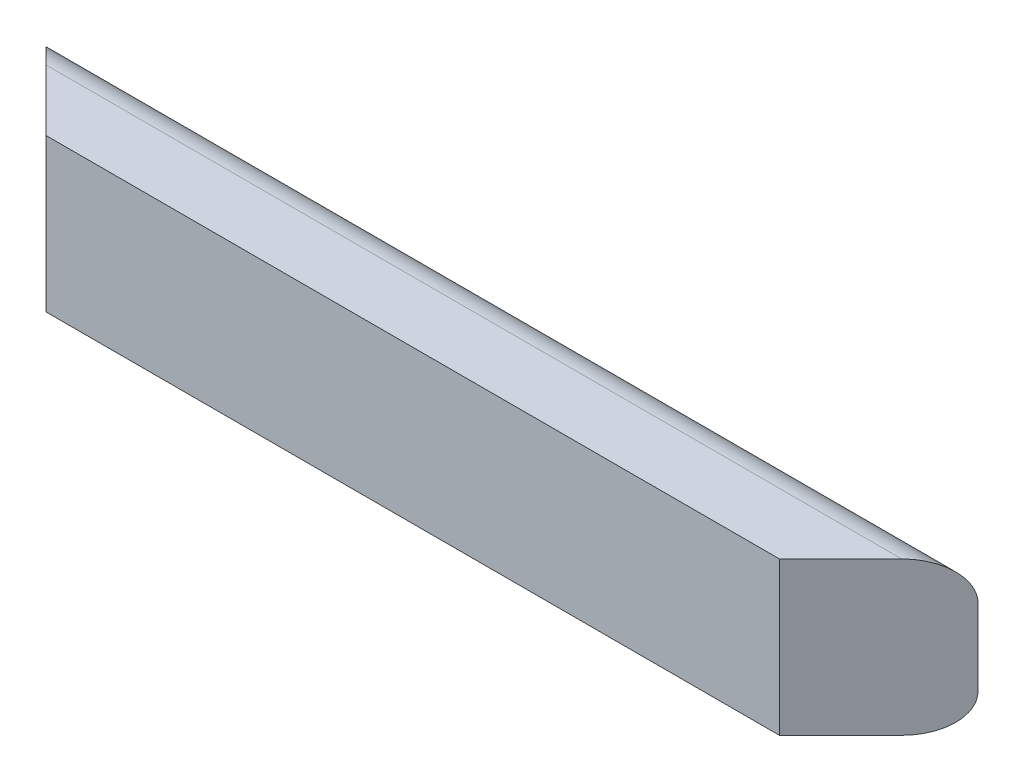
ISO-10303-21;
HEADER;
FILE_DESCRIPTION(('STEP AP214'),'2;1');
FILE_NAME('part.step','',(''),(''),'','','');
FILE_SCHEMA(('AUTOMOTIVE_DESIGN { 1 0 10303 214 1 1 1 1 }'));
ENDSEC;
DATA;
#1=APPLICATION_CONTEXT('core data for automotive mechanical design processes');
#2=APPLICATION_PROTOCOL_DEFINITION('international standard','automotive_design',2000,#1);
#3=PRODUCT_CONTEXT('',#1,'mechanical');
#4=PRODUCT('Part','Part','',(#3));
#5=PRODUCT_RELATED_PRODUCT_CATEGORY('part','',(#4));
#6=PRODUCT_DEFINITION_FORMATION('','',#4);
#7=PRODUCT_DEFINITION_CONTEXT('part definition',#1,'design');
#8=PRODUCT_DEFINITION('design','',#6,#7);
#9=PRODUCT_DEFINITION_SHAPE('','',#8);
#10=(LENGTH_UNIT() NAMED_UNIT(*) SI_UNIT(.MILLI.,.METRE.));
#11=(NAMED_UNIT(*) PLANE_ANGLE_UNIT() SI_UNIT($,.RADIAN.));
#12=(NAMED_UNIT(*) SI_UNIT($,.STERADIAN.) SOLID_ANGLE_UNIT());
#13=UNCERTAINTY_MEASURE_WITH_UNIT(LENGTH_MEASURE(1.E-05),#10,'distance_accuracy_value','');
#14=(GEOMETRIC_REPRESENTATION_CONTEXT(3) GLOBAL_UNCERTAINTY_ASSIGNED_CONTEXT((#13)) GLOBAL_UNIT_ASSIGNED_CONTEXT((#10,
#11,#12)) REPRESENTATION_CONTEXT('',''));
#15=CARTESIAN_POINT('',(0.,0.,0.));
#16=DIRECTION('',(0.,0.,1.));
#17=DIRECTION('',(1.,0.,0.));
#18=AXIS2_PLACEMENT_3D('',#15,#16,#17);
#19=CARTESIAN_POINT('',(774.7,0.,0.));
#20=DIRECTION('',(0.,1.,0.));
#21=DIRECTION('',(0.,0.,1.));
#22=AXIS2_PLACEMENT_3D('',#19,#20,#21);
#23=PLANE('',#22);
#24=DIRECTION('',(-1.,0.,0.));
#25=VECTOR('',#24,1.);
#26=CARTESIAN_POINT('',(774.7,0.,19.05));
#27=LINE('',#26,#25);
#28=CARTESIAN_POINT('',(692.15,0.,19.05));
#29=VERTEX_POINT('',#28);
#30=CARTESIAN_POINT('',(82.5500000000001,0.,19.05));
#31=VERTEX_POINT('',#30);
#32=EDGE_CURVE('E110',#29,#31,#27,.T.);
#33=ORIENTED_EDGE('',*,*,#32,.T.);
#34=DIRECTION('',(-0.707106781186549,0.,-0.707106781186546));
#35=VECTOR('',#34,1.);
#36=CARTESIAN_POINT('',(419.100000000001,0.,355.6));
#37=LINE('',#36,#35);
#38=CARTESIAN_POINT('',(31.7499999999998,0.,-31.7499999999999));
#39=VERTEX_POINT('',#38);
#40=EDGE_CURVE('E98',#31,#39,#37,.T.);
#41=ORIENTED_EDGE('',*,*,#40,.T.);
#42=DIRECTION('',(-1.,0.,0.));
#43=VECTOR('',#42,1.);
#44=CARTESIAN_POINT('',(774.7,0.,-31.75));
#45=LINE('',#44,#43);
#46=CARTESIAN_POINT('',(742.95,0.,-31.75));
#47=VERTEX_POINT('',#46);
#48=EDGE_CURVE('E11',#47,#39,#45,.T.);
#49=ORIENTED_EDGE('',*,*,#48,.F.);
#50=DIRECTION('',(-0.707106781186549,0.,0.707106781186546));
#51=VECTOR('',#50,1.);
#52=CARTESIAN_POINT('',(742.95,0.,-31.75));
#53=LINE('',#52,#51);
#54=EDGE_CURVE('E115',#47,#29,#53,.T.);
#55=ORIENTED_EDGE('',*,*,#54,.T.);
#56=EDGE_LOOP('',(#33,#41,#49,#55));
#57=FACE_BOUND('',#56,.T.);
#58=ADVANCED_FACE('F33',(#57),#23,.F.);
#59=CARTESIAN_POINT('',(774.7,31.75,-31.75));
#60=DIRECTION('',(-1.,0.,0.));
#61=DIRECTION('',(0.,0.,1.));
#62=AXIS2_PLACEMENT_3D('',#59,#60,#61);
#63=CYLINDRICAL_SURFACE('',#62,31.75);
#64=ORIENTED_EDGE('',*,*,#48,.T.);
#65=CARTESIAN_POINT('',(31.7499999999997,31.75,-31.75));
#66=DIRECTION('',(0.707106781186546,0.,-0.707106781186549));
#67=DIRECTION('',(-0.707106781186549,0.,-0.707106781186546));
#68=AXIS2_PLACEMENT_3D('',#65,#66,#67);
#69=ELLIPSE('',#68,44.9012806053458,31.75);
#70=CARTESIAN_POINT('',(0.,31.75,-63.4999999999998));
#71=VERTEX_POINT('',#70);
#72=EDGE_CURVE('E83',#39,#71,#69,.T.);
#73=ORIENTED_EDGE('',*,*,#72,.T.);
#74=DIRECTION('',(-1.,0.,0.));
#75=VECTOR('',#74,1.);
#76=CARTESIAN_POINT('',(774.7,31.75,-63.5));
#77=LINE('',#76,#75);
#78=CARTESIAN_POINT('',(774.7,31.75,-63.5));
#79=VERTEX_POINT('',#78);
#80=EDGE_CURVE('E41',#79,#71,#77,.T.);
#81=ORIENTED_EDGE('',*,*,#80,.F.);
#82=CARTESIAN_POINT('',(742.95,31.75,-31.75));
#83=DIRECTION('',(-0.707106781186546,0.,-0.707106781186549));
#84=DIRECTION('',(-0.707106781186549,0.,0.707106781186546));
#85=AXIS2_PLACEMENT_3D('',#82,#83,#84);
#86=ELLIPSE('',#85,44.9012806053458,31.75);
#87=EDGE_CURVE('E47',#79,#47,#86,.T.);
#88=ORIENTED_EDGE('',*,*,#87,.T.);
#89=EDGE_LOOP('',(#64,#73,#81,#88));
#90=FACE_BOUND('',#89,.T.);
#91=ADVANCED_FACE('F94',(#90),#63,.T.);
#92=CARTESIAN_POINT('',(774.7,95.25,-63.5));
#93=DIRECTION('',(0.,0.,1.));
#94=DIRECTION('',(1.,0.,0.));
#95=AXIS2_PLACEMENT_3D('',#92,#93,#94);
#96=PLANE('',#95);
#97=DIRECTION('',(0.,1.,0.));
#98=VECTOR('',#97,1.);
#99=CARTESIAN_POINT('',(0.,95.25,-63.5));
#100=LINE('',#99,#98);
#101=CARTESIAN_POINT('',(0.,95.25,-63.5));
#102=VERTEX_POINT('',#101);
#103=EDGE_CURVE('E80',#71,#102,#100,.T.);
#104=ORIENTED_EDGE('',*,*,#103,.T.);
#105=DIRECTION('',(-1.,0.,0.));
#106=VECTOR('',#105,1.);
#107=CARTESIAN_POINT('',(774.7,95.25,-63.5));
#108=LINE('',#107,#106);
#109=CARTESIAN_POINT('',(774.7,95.25,-63.4999999999998));
#110=VERTEX_POINT('',#109);
#111=EDGE_CURVE('E101',#110,#102,#108,.T.);
#112=ORIENTED_EDGE('',*,*,#111,.F.);
#113=DIRECTION('',(0.,1.,0.));
#114=VECTOR('',#113,1.);
#115=CARTESIAN_POINT('',(774.7,95.25,-63.5));
#116=LINE('',#115,#114);
#117=EDGE_CURVE('E91',#79,#110,#116,.T.);
#118=ORIENTED_EDGE('',*,*,#117,.F.);
#119=ORIENTED_EDGE('',*,*,#80,.T.);
#120=EDGE_LOOP('',(#104,#112,#118,#119));
#121=FACE_BOUND('',#120,.T.);
#122=ADVANCED_FACE('F100',(#121),#96,.F.);
#123=CARTESIAN_POINT('',(774.7,95.25,-31.75));
#124=DIRECTION('',(-1.,0.,0.));
#125=DIRECTION('',(0.,0.,1.));
#126=AXIS2_PLACEMENT_3D('',#123,#124,#125);
#127=CYLINDRICAL_SURFACE('',#126,31.75);
#128=ORIENTED_EDGE('',*,*,#111,.T.);
#129=CARTESIAN_POINT('',(31.7499999999997,95.25,-31.75));
#130=DIRECTION('',(0.707106781186546,0.,-0.707106781186549));
#131=DIRECTION('',(-0.707106781186549,0.,-0.707106781186546));
#132=AXIS2_PLACEMENT_3D('',#129,#130,#131);
#133=ELLIPSE('',#132,44.9012806053458,31.75);
#134=CARTESIAN_POINT('',(31.7499999999997,127.,-31.75));
#135=VERTEX_POINT('',#134);
#136=EDGE_CURVE('E86',#102,#135,#133,.T.);
#137=ORIENTED_EDGE('',*,*,#136,.T.);
#138=DIRECTION('',(-1.,0.,0.));
#139=VECTOR('',#138,1.);
#140=CARTESIAN_POINT('',(774.7,127.,-31.75));
#141=LINE('',#140,#139);
#142=CARTESIAN_POINT('',(742.95,127.,-31.75));
#143=VERTEX_POINT('',#142);
#144=EDGE_CURVE('E102',#143,#135,#141,.T.);
#145=ORIENTED_EDGE('',*,*,#144,.F.);
#146=CARTESIAN_POINT('',(742.95,95.25,-31.75));
#147=DIRECTION('',(-0.707106781186546,0.,-0.707106781186549));
#148=DIRECTION('',(-0.707106781186549,0.,0.707106781186546));
#149=AXIS2_PLACEMENT_3D('',#146,#147,#148);
#150=ELLIPSE('',#149,44.9012806053458,31.75);
#151=EDGE_CURVE('E97',#143,#110,#150,.T.);
#152=ORIENTED_EDGE('',*,*,#151,.T.);
#153=EDGE_LOOP('',(#128,#137,#145,#152));
#154=FACE_BOUND('',#153,.T.);
#155=ADVANCED_FACE('F135',(#154),#127,.T.);
#156=CARTESIAN_POINT('',(774.7,127.,19.05));
#157=DIRECTION('',(0.,-1.,0.));
#158=DIRECTION('',(0.,0.,-1.));
#159=AXIS2_PLACEMENT_3D('',#156,#157,#158);
#160=PLANE('',#159);
#161=ORIENTED_EDGE('',*,*,#144,.T.);
#162=DIRECTION('',(0.707106781186549,0.,0.707106781186546));
#163=VECTOR('',#162,1.);
#164=CARTESIAN_POINT('',(428.625000000001,127.,365.125));
#165=LINE('',#164,#163);
#166=CARTESIAN_POINT('',(82.55,127.,19.05));
#167=VERTEX_POINT('',#166);
#168=EDGE_CURVE('E130',#135,#167,#165,.T.);
#169=ORIENTED_EDGE('',*,*,#168,.T.);
#170=DIRECTION('',(-1.,0.,0.));
#171=VECTOR('',#170,1.);
#172=CARTESIAN_POINT('',(774.7,127.,19.05));
#173=LINE('',#172,#171);
#174=CARTESIAN_POINT('',(692.15,127.,19.05));
#175=VERTEX_POINT('',#174);
#176=EDGE_CURVE('E107',#175,#167,#173,.T.);
#177=ORIENTED_EDGE('',*,*,#176,.F.);
#178=DIRECTION('',(0.707106781186549,0.,-0.707106781186546));
#179=VECTOR('',#178,1.);
#180=CARTESIAN_POINT('',(733.425,127.,-22.2250000000001));
#181=LINE('',#180,#179);
#182=EDGE_CURVE('E121',#175,#143,#181,.T.);
#183=ORIENTED_EDGE('',*,*,#182,.T.);
#184=EDGE_LOOP('',(#161,#169,#177,#183));
#185=FACE_BOUND('',#184,.T.);
#186=ADVANCED_FACE('F137',(#185),#160,.F.);
#187=CARTESIAN_POINT('',(774.7,0.,19.05));
#188=DIRECTION('',(0.,0.,-1.));
#189=DIRECTION('',(-1.,0.,0.));
#190=AXIS2_PLACEMENT_3D('',#187,#188,#189);
#191=PLANE('',#190);
#192=ORIENTED_EDGE('',*,*,#176,.T.);
#193=DIRECTION('',(0.,-1.,0.));
#194=VECTOR('',#193,1.);
#195=CARTESIAN_POINT('',(82.5500000000001,0.,19.05));
#196=LINE('',#195,#194);
#197=EDGE_CURVE('E127',#167,#31,#196,.T.);
#198=ORIENTED_EDGE('',*,*,#197,.T.);
#199=ORIENTED_EDGE('',*,*,#32,.F.);
#200=DIRECTION('',(0.,1.,0.));
#201=VECTOR('',#200,1.);
#202=CARTESIAN_POINT('',(692.15,0.,19.05));
#203=LINE('',#202,#201);
#204=EDGE_CURVE('E118',#29,#175,#203,.T.);
#205=ORIENTED_EDGE('',*,*,#204,.T.);
#206=EDGE_LOOP('',(#192,#198,#199,#205));
#207=FACE_BOUND('',#206,.T.);
#208=ADVANCED_FACE('F142',(#207),#191,.F.);
#209=CARTESIAN_POINT('',(355.599999999999,0.,355.6));
#210=DIRECTION('',(-0.707106781186546,0.,-0.707106781186549));
#211=DIRECTION('',(-0.707106781186549,0.,0.707106781186546));
#212=AXIS2_PLACEMENT_3D('',#209,#210,#211);
#213=PLANE('',#212);
#214=ORIENTED_EDGE('',*,*,#117,.T.);
#215=ORIENTED_EDGE('',*,*,#151,.F.);
#216=ORIENTED_EDGE('',*,*,#182,.F.);
#217=ORIENTED_EDGE('',*,*,#204,.F.);
#218=ORIENTED_EDGE('',*,*,#54,.F.);
#219=ORIENTED_EDGE('',*,*,#87,.F.);
#220=EDGE_LOOP('',(#214,#215,#216,#217,#218,#219));
#221=FACE_BOUND('',#220,.T.);
#222=ADVANCED_FACE('F139',(#221),#213,.F.);
#223=CARTESIAN_POINT('',(419.100000000001,0.,355.6));
#224=DIRECTION('',(0.707106781186546,0.,-0.707106781186549));
#225=DIRECTION('',(0.707106781186549,0.,0.707106781186546));
#226=AXIS2_PLACEMENT_3D('',#223,#224,#225);
#227=PLANE('',#226);
#228=ORIENTED_EDGE('',*,*,#40,.F.);
#229=ORIENTED_EDGE('',*,*,#197,.F.);
#230=ORIENTED_EDGE('',*,*,#168,.F.);
#231=ORIENTED_EDGE('',*,*,#136,.F.);
#232=ORIENTED_EDGE('',*,*,#103,.F.);
#233=ORIENTED_EDGE('',*,*,#72,.F.);
#234=EDGE_LOOP('',(#228,#229,#230,#231,#232,#233));
#235=FACE_BOUND('',#234,.T.);
#236=ADVANCED_FACE('F82',(#235),#227,.F.);
#237=CLOSED_SHELL('',(#58,#91,#122,#155,#186,#208,#222,#236));
#238=MANIFOLD_SOLID_BREP('B2',#237);
#239=ADVANCED_BREP_SHAPE_REPRESENTATION('',(#18,#238),#14);
#240=SHAPE_DEFINITION_REPRESENTATION(#9,#239);
ENDSEC;
END-ISO-10303-21;
